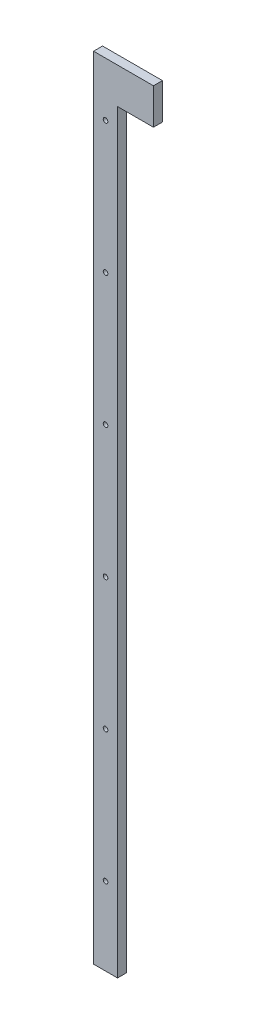
ISO-10303-21;
HEADER;
FILE_DESCRIPTION(('STEP AP214'),'2;1');
FILE_NAME('part.step','',(''),(''),'','','');
FILE_SCHEMA(('AUTOMOTIVE_DESIGN { 1 0 10303 214 1 1 1 1 }'));
ENDSEC;
DATA;
#1=APPLICATION_CONTEXT('core data for automotive mechanical design processes');
#2=APPLICATION_PROTOCOL_DEFINITION('international standard','automotive_design',2000,#1);
#3=PRODUCT_CONTEXT('',#1,'mechanical');
#4=PRODUCT('Part','Part','',(#3));
#5=PRODUCT_RELATED_PRODUCT_CATEGORY('part','',(#4));
#6=PRODUCT_DEFINITION_FORMATION('','',#4);
#7=PRODUCT_DEFINITION_CONTEXT('part definition',#1,'design');
#8=PRODUCT_DEFINITION('design','',#6,#7);
#9=PRODUCT_DEFINITION_SHAPE('','',#8);
#10=(LENGTH_UNIT() NAMED_UNIT(*) SI_UNIT(.MILLI.,.METRE.));
#11=(NAMED_UNIT(*) PLANE_ANGLE_UNIT() SI_UNIT($,.RADIAN.));
#12=(NAMED_UNIT(*) SI_UNIT($,.STERADIAN.) SOLID_ANGLE_UNIT());
#13=UNCERTAINTY_MEASURE_WITH_UNIT(LENGTH_MEASURE(1.E-05),#10,'distance_accuracy_value','');
#14=(GEOMETRIC_REPRESENTATION_CONTEXT(3) GLOBAL_UNCERTAINTY_ASSIGNED_CONTEXT((#13)) GLOBAL_UNIT_ASSIGNED_CONTEXT((#10,
#11,#12)) REPRESENTATION_CONTEXT('',''));
#15=CARTESIAN_POINT('',(0.,0.,0.));
#16=DIRECTION('',(0.,0.,1.));
#17=DIRECTION('',(1.,0.,0.));
#18=AXIS2_PLACEMENT_3D('',#15,#16,#17);
#19=CARTESIAN_POINT('',(0.,0.,9.525));
#20=DIRECTION('',(0.,0.,1.));
#21=DIRECTION('',(1.,0.,0.));
#22=AXIS2_PLACEMENT_3D('',#19,#20,#21);
#23=PLANE('',#22);
#24=CARTESIAN_POINT('',(0.,349.25,9.525));
#25=DIRECTION('',(0.,0.,-1.));
#26=DIRECTION('',(-1.,0.,0.));
#27=AXIS2_PLACEMENT_3D('',#24,#25,#26);
#28=CIRCLE('',#27,2.4384);
#29=CARTESIAN_POINT('',(-2.4384,349.25,9.525));
#30=VERTEX_POINT('',#29);
#31=EDGE_CURVE('E111',#30,#30,#28,.T.);
#32=ORIENTED_EDGE('',*,*,#31,.T.);
#33=EDGE_LOOP('',(#32));
#34=FACE_BOUND('',#33,.T.);
#35=CARTESIAN_POINT('',(0.,-349.25,9.525));
#36=DIRECTION('',(0.,0.,-1.));
#37=DIRECTION('',(-1.,0.,0.));
#38=AXIS2_PLACEMENT_3D('',#35,#36,#37);
#39=CIRCLE('',#38,2.4384);
#40=CARTESIAN_POINT('',(-2.4384,-349.25,9.525));
#41=VERTEX_POINT('',#40);
#42=EDGE_CURVE('E114',#41,#41,#39,.T.);
#43=ORIENTED_EDGE('',*,*,#42,.T.);
#44=EDGE_LOOP('',(#43));
#45=FACE_BOUND('',#44,.T.);
#46=CARTESIAN_POINT('',(0.,-209.55,9.525));
#47=DIRECTION('',(0.,0.,-1.));
#48=DIRECTION('',(-1.,0.,0.));
#49=AXIS2_PLACEMENT_3D('',#46,#47,#48);
#50=CIRCLE('',#49,2.4384);
#51=CARTESIAN_POINT('',(-2.4384,-209.55,9.525));
#52=VERTEX_POINT('',#51);
#53=EDGE_CURVE('E117',#52,#52,#50,.T.);
#54=ORIENTED_EDGE('',*,*,#53,.T.);
#55=EDGE_LOOP('',(#54));
#56=FACE_BOUND('',#55,.T.);
#57=CARTESIAN_POINT('',(0.,-69.85,9.525));
#58=DIRECTION('',(0.,0.,-1.));
#59=DIRECTION('',(-1.,0.,0.));
#60=AXIS2_PLACEMENT_3D('',#57,#58,#59);
#61=CIRCLE('',#60,2.4384);
#62=CARTESIAN_POINT('',(-2.4384,-69.85,9.525));
#63=VERTEX_POINT('',#62);
#64=EDGE_CURVE('E120',#63,#63,#61,.T.);
#65=ORIENTED_EDGE('',*,*,#64,.T.);
#66=EDGE_LOOP('',(#65));
#67=FACE_BOUND('',#66,.T.);
#68=CARTESIAN_POINT('',(0.,69.85,9.525));
#69=DIRECTION('',(0.,0.,-1.));
#70=DIRECTION('',(-1.,0.,0.));
#71=AXIS2_PLACEMENT_3D('',#68,#69,#70);
#72=CIRCLE('',#71,2.4384);
#73=CARTESIAN_POINT('',(-2.4384,69.85,9.525));
#74=VERTEX_POINT('',#73);
#75=EDGE_CURVE('E122',#74,#74,#72,.T.);
#76=ORIENTED_EDGE('',*,*,#75,.T.);
#77=EDGE_LOOP('',(#76));
#78=FACE_BOUND('',#77,.T.);
#79=CARTESIAN_POINT('',(0.,209.55,9.525));
#80=DIRECTION('',(0.,0.,-1.));
#81=DIRECTION('',(-1.,0.,0.));
#82=AXIS2_PLACEMENT_3D('',#79,#80,#81);
#83=CIRCLE('',#82,2.4384);
#84=CARTESIAN_POINT('',(-2.4384,209.55,9.525));
#85=VERTEX_POINT('',#84);
#86=EDGE_CURVE('E19',#85,#85,#83,.T.);
#87=ORIENTED_EDGE('',*,*,#86,.T.);
#88=EDGE_LOOP('',(#87));
#89=FACE_BOUND('',#88,.T.);
#90=DIRECTION('',(0.,1.,0.));
#91=VECTOR('',#90,1.);
#92=CARTESIAN_POINT('',(50.8,0.,9.525));
#93=LINE('',#92,#91);
#94=CARTESIAN_POINT('',(50.8,406.4,9.525));
#95=VERTEX_POINT('',#94);
#96=CARTESIAN_POINT('',(50.8,368.3,9.525));
#97=VERTEX_POINT('',#96);
#98=EDGE_CURVE('E84',#95,#97,#93,.F.);
#99=ORIENTED_EDGE('',*,*,#98,.F.);
#100=DIRECTION('',(1.,0.,0.));
#101=VECTOR('',#100,1.);
#102=CARTESIAN_POINT('',(-12.7,406.4,9.525));
#103=LINE('',#102,#101);
#104=CARTESIAN_POINT('',(-12.7,406.4,9.525));
#105=VERTEX_POINT('',#104);
#106=EDGE_CURVE('E80',#95,#105,#103,.F.);
#107=ORIENTED_EDGE('',*,*,#106,.T.);
#108=DIRECTION('',(0.,1.,0.));
#109=VECTOR('',#108,1.);
#110=CARTESIAN_POINT('',(-12.7,431.8,9.525));
#111=LINE('',#110,#109);
#112=CARTESIAN_POINT('',(-12.7,-431.8,9.525));
#113=VERTEX_POINT('',#112);
#114=EDGE_CURVE('E71',#113,#105,#111,.T.);
#115=ORIENTED_EDGE('',*,*,#114,.F.);
#116=DIRECTION('',(1.,0.,0.));
#117=VECTOR('',#116,1.);
#118=CARTESIAN_POINT('',(-12.7,-431.8,9.525));
#119=LINE('',#118,#117);
#120=CARTESIAN_POINT('',(12.7,-431.8,9.525));
#121=VERTEX_POINT('',#120);
#122=EDGE_CURVE('E66',#121,#113,#119,.F.);
#123=ORIENTED_EDGE('',*,*,#122,.F.);
#124=DIRECTION('',(0.,1.,0.));
#125=VECTOR('',#124,1.);
#126=CARTESIAN_POINT('',(12.7,-431.8,9.525));
#127=LINE('',#126,#125);
#128=CARTESIAN_POINT('',(12.7,368.3,9.525));
#129=VERTEX_POINT('',#128);
#130=EDGE_CURVE('E142',#129,#121,#127,.F.);
#131=ORIENTED_EDGE('',*,*,#130,.F.);
#132=DIRECTION('',(1.,0.,0.));
#133=VECTOR('',#132,1.);
#134=CARTESIAN_POINT('',(12.7,368.3,9.525));
#135=LINE('',#134,#133);
#136=EDGE_CURVE('E138',#97,#129,#135,.F.);
#137=ORIENTED_EDGE('',*,*,#136,.F.);
#138=EDGE_LOOP('',(#99,#107,#115,#123,#131,#137));
#139=FACE_BOUND('',#138,.T.);
#140=ADVANCED_FACE('F16',(#34,#45,#56,#67,#78,#89,#139),#23,.T.);
#141=CARTESIAN_POINT('',(-12.7,406.4,9.525));
#142=DIRECTION('',(0.,-1.,0.));
#143=DIRECTION('',(0.,0.,-1.));
#144=AXIS2_PLACEMENT_3D('',#141,#142,#143);
#145=PLANE('',#144);
#146=ORIENTED_EDGE('',*,*,#106,.F.);
#147=DIRECTION('',(0.,0.,-1.));
#148=VECTOR('',#147,1.);
#149=CARTESIAN_POINT('',(50.8,406.4,0.));
#150=LINE('',#149,#148);
#151=CARTESIAN_POINT('',(50.8,406.4,0.));
#152=VERTEX_POINT('',#151);
#153=EDGE_CURVE('E127',#152,#95,#150,.F.);
#154=ORIENTED_EDGE('',*,*,#153,.F.);
#155=DIRECTION('',(1.,0.,0.));
#156=VECTOR('',#155,1.);
#157=CARTESIAN_POINT('',(0.,406.4,0.));
#158=LINE('',#157,#156);
#159=CARTESIAN_POINT('',(-12.7,406.4,0.));
#160=VERTEX_POINT('',#159);
#161=EDGE_CURVE('E91',#152,#160,#158,.F.);
#162=ORIENTED_EDGE('',*,*,#161,.T.);
#163=DIRECTION('',(0.,0.,1.));
#164=VECTOR('',#163,1.);
#165=CARTESIAN_POINT('',(-12.7,406.4,0.));
#166=LINE('',#165,#164);
#167=EDGE_CURVE('E76',#105,#160,#166,.F.);
#168=ORIENTED_EDGE('',*,*,#167,.F.);
#169=EDGE_LOOP('',(#146,#154,#162,#168));
#170=FACE_BOUND('',#169,.T.);
#171=ADVANCED_FACE('F90',(#170),#145,.F.);
#172=CARTESIAN_POINT('',(-12.7,431.8,0.));
#173=DIRECTION('',(-1.,0.,0.));
#174=DIRECTION('',(0.,0.,1.));
#175=AXIS2_PLACEMENT_3D('',#172,#173,#174);
#176=PLANE('',#175);
#177=ORIENTED_EDGE('',*,*,#114,.T.);
#178=ORIENTED_EDGE('',*,*,#167,.T.);
#179=DIRECTION('',(0.,1.,0.));
#180=VECTOR('',#179,1.);
#181=CARTESIAN_POINT('',(-12.7,0.,0.));
#182=LINE('',#181,#180);
#183=CARTESIAN_POINT('',(-12.7,-431.8,0.));
#184=VERTEX_POINT('',#183);
#185=EDGE_CURVE('E151',#160,#184,#182,.F.);
#186=ORIENTED_EDGE('',*,*,#185,.T.);
#187=DIRECTION('',(0.,0.,-1.));
#188=VECTOR('',#187,1.);
#189=CARTESIAN_POINT('',(-12.7,-431.8,0.));
#190=LINE('',#189,#188);
#191=EDGE_CURVE('E78',#113,#184,#190,.T.);
#192=ORIENTED_EDGE('',*,*,#191,.F.);
#193=EDGE_LOOP('',(#177,#178,#186,#192));
#194=FACE_BOUND('',#193,.T.);
#195=ADVANCED_FACE('F73',(#194),#176,.T.);
#196=CARTESIAN_POINT('',(-12.7,-431.8,0.));
#197=DIRECTION('',(0.,-1.,0.));
#198=DIRECTION('',(0.,0.,-1.));
#199=AXIS2_PLACEMENT_3D('',#196,#197,#198);
#200=PLANE('',#199);
#201=ORIENTED_EDGE('',*,*,#191,.T.);
#202=DIRECTION('',(1.,0.,0.));
#203=VECTOR('',#202,1.);
#204=CARTESIAN_POINT('',(0.,-431.8,0.));
#205=LINE('',#204,#203);
#206=CARTESIAN_POINT('',(12.7,-431.8,0.));
#207=VERTEX_POINT('',#206);
#208=EDGE_CURVE('E146',#184,#207,#205,.T.);
#209=ORIENTED_EDGE('',*,*,#208,.T.);
#210=DIRECTION('',(0.,0.,-1.));
#211=VECTOR('',#210,1.);
#212=CARTESIAN_POINT('',(12.7,-431.8,0.));
#213=LINE('',#212,#211);
#214=EDGE_CURVE('E140',#121,#207,#213,.T.);
#215=ORIENTED_EDGE('',*,*,#214,.F.);
#216=ORIENTED_EDGE('',*,*,#122,.T.);
#217=EDGE_LOOP('',(#201,#209,#215,#216));
#218=FACE_BOUND('',#217,.T.);
#219=ADVANCED_FACE('F145',(#218),#200,.T.);
#220=CARTESIAN_POINT('',(12.7,-431.8,0.));
#221=DIRECTION('',(1.,0.,0.));
#222=DIRECTION('',(0.,0.,-1.));
#223=AXIS2_PLACEMENT_3D('',#220,#221,#222);
#224=PLANE('',#223);
#225=DIRECTION('',(0.,1.,0.));
#226=VECTOR('',#225,1.);
#227=CARTESIAN_POINT('',(12.7,0.,0.));
#228=LINE('',#227,#226);
#229=CARTESIAN_POINT('',(12.7,368.3,0.));
#230=VERTEX_POINT('',#229);
#231=EDGE_CURVE('E153',#207,#230,#228,.T.);
#232=ORIENTED_EDGE('',*,*,#231,.T.);
#233=DIRECTION('',(0.,0.,-1.));
#234=VECTOR('',#233,1.);
#235=CARTESIAN_POINT('',(12.7,368.3,9.525));
#236=LINE('',#235,#234);
#237=EDGE_CURVE('E136',#129,#230,#236,.T.);
#238=ORIENTED_EDGE('',*,*,#237,.F.);
#239=ORIENTED_EDGE('',*,*,#130,.T.);
#240=ORIENTED_EDGE('',*,*,#214,.T.);
#241=EDGE_LOOP('',(#232,#238,#239,#240));
#242=FACE_BOUND('',#241,.T.);
#243=ADVANCED_FACE('F166',(#242),#224,.T.);
#244=CARTESIAN_POINT('',(12.7,368.3,9.525));
#245=DIRECTION('',(0.,-1.,0.));
#246=DIRECTION('',(0.,0.,-1.));
#247=AXIS2_PLACEMENT_3D('',#244,#245,#246);
#248=PLANE('',#247);
#249=ORIENTED_EDGE('',*,*,#136,.T.);
#250=ORIENTED_EDGE('',*,*,#237,.T.);
#251=DIRECTION('',(1.,0.,0.));
#252=VECTOR('',#251,1.);
#253=CARTESIAN_POINT('',(0.,368.3,0.));
#254=LINE('',#253,#252);
#255=CARTESIAN_POINT('',(50.8,368.3,0.));
#256=VERTEX_POINT('',#255);
#257=EDGE_CURVE('E157',#230,#256,#254,.T.);
#258=ORIENTED_EDGE('',*,*,#257,.T.);
#259=DIRECTION('',(0.,0.,-1.));
#260=VECTOR('',#259,1.);
#261=CARTESIAN_POINT('',(50.8,368.3,0.));
#262=LINE('',#261,#260);
#263=EDGE_CURVE('E34',#97,#256,#262,.T.);
#264=ORIENTED_EDGE('',*,*,#263,.F.);
#265=EDGE_LOOP('',(#249,#250,#258,#264));
#266=FACE_BOUND('',#265,.T.);
#267=ADVANCED_FACE('F162',(#266),#248,.T.);
#268=CARTESIAN_POINT('',(50.8,0.,0.));
#269=DIRECTION('',(1.,0.,0.));
#270=DIRECTION('',(0.,0.,-1.));
#271=AXIS2_PLACEMENT_3D('',#268,#269,#270);
#272=PLANE('',#271);
#273=DIRECTION('',(0.,1.,0.));
#274=VECTOR('',#273,1.);
#275=CARTESIAN_POINT('',(50.8,0.,0.));
#276=LINE('',#275,#274);
#277=EDGE_CURVE('E110',#256,#152,#276,.T.);
#278=ORIENTED_EDGE('',*,*,#277,.T.);
#279=ORIENTED_EDGE('',*,*,#153,.T.);
#280=ORIENTED_EDGE('',*,*,#98,.T.);
#281=ORIENTED_EDGE('',*,*,#263,.T.);
#282=EDGE_LOOP('',(#278,#279,#280,#281));
#283=FACE_BOUND('',#282,.T.);
#284=ADVANCED_FACE('F160',(#283),#272,.T.);
#285=CARTESIAN_POINT('',(0.,209.55,9.525));
#286=DIRECTION('',(0.,0.,-1.));
#287=DIRECTION('',(-1.,0.,0.));
#288=AXIS2_PLACEMENT_3D('',#285,#286,#287);
#289=CYLINDRICAL_SURFACE('',#288,2.4384);
#290=ORIENTED_EDGE('',*,*,#86,.F.);
#291=EDGE_LOOP('',(#290));
#292=FACE_BOUND('',#291,.T.);
#293=CARTESIAN_POINT('',(0.,209.55,0.));
#294=DIRECTION('',(0.,0.,-1.));
#295=DIRECTION('',(-1.,0.,0.));
#296=AXIS2_PLACEMENT_3D('',#293,#294,#295);
#297=CIRCLE('',#296,2.4384);
#298=CARTESIAN_POINT('',(-2.4384,209.55,0.));
#299=VERTEX_POINT('',#298);
#300=EDGE_CURVE('E107',#299,#299,#297,.T.);
#301=ORIENTED_EDGE('',*,*,#300,.T.);
#302=EDGE_LOOP('',(#301));
#303=FACE_BOUND('',#302,.T.);
#304=ADVANCED_FACE('F203',(#292,#303),#289,.F.);
#305=CARTESIAN_POINT('',(0.,69.85,9.525));
#306=DIRECTION('',(0.,0.,-1.));
#307=DIRECTION('',(-1.,0.,0.));
#308=AXIS2_PLACEMENT_3D('',#305,#306,#307);
#309=CYLINDRICAL_SURFACE('',#308,2.4384);
#310=ORIENTED_EDGE('',*,*,#75,.F.);
#311=EDGE_LOOP('',(#310));
#312=FACE_BOUND('',#311,.T.);
#313=CARTESIAN_POINT('',(0.,69.85,0.));
#314=DIRECTION('',(0.,0.,-1.));
#315=DIRECTION('',(-1.,0.,0.));
#316=AXIS2_PLACEMENT_3D('',#313,#314,#315);
#317=CIRCLE('',#316,2.4384);
#318=CARTESIAN_POINT('',(-2.4384,69.85,0.));
#319=VERTEX_POINT('',#318);
#320=EDGE_CURVE('E104',#319,#319,#317,.T.);
#321=ORIENTED_EDGE('',*,*,#320,.T.);
#322=EDGE_LOOP('',(#321));
#323=FACE_BOUND('',#322,.T.);
#324=ADVANCED_FACE('F199',(#312,#323),#309,.F.);
#325=CARTESIAN_POINT('',(0.,-69.85,9.525));
#326=DIRECTION('',(0.,0.,-1.));
#327=DIRECTION('',(-1.,0.,0.));
#328=AXIS2_PLACEMENT_3D('',#325,#326,#327);
#329=CYLINDRICAL_SURFACE('',#328,2.4384);
#330=ORIENTED_EDGE('',*,*,#64,.F.);
#331=EDGE_LOOP('',(#330));
#332=FACE_BOUND('',#331,.T.);
#333=CARTESIAN_POINT('',(0.,-69.85,0.));
#334=DIRECTION('',(0.,0.,-1.));
#335=DIRECTION('',(-1.,0.,0.));
#336=AXIS2_PLACEMENT_3D('',#333,#334,#335);
#337=CIRCLE('',#336,2.4384);
#338=CARTESIAN_POINT('',(-2.4384,-69.85,0.));
#339=VERTEX_POINT('',#338);
#340=EDGE_CURVE('E101',#339,#339,#337,.T.);
#341=ORIENTED_EDGE('',*,*,#340,.T.);
#342=EDGE_LOOP('',(#341));
#343=FACE_BOUND('',#342,.T.);
#344=ADVANCED_FACE('F195',(#332,#343),#329,.F.);
#345=CARTESIAN_POINT('',(0.,-209.55,9.525));
#346=DIRECTION('',(0.,0.,-1.));
#347=DIRECTION('',(-1.,0.,0.));
#348=AXIS2_PLACEMENT_3D('',#345,#346,#347);
#349=CYLINDRICAL_SURFACE('',#348,2.4384);
#350=ORIENTED_EDGE('',*,*,#53,.F.);
#351=EDGE_LOOP('',(#350));
#352=FACE_BOUND('',#351,.T.);
#353=CARTESIAN_POINT('',(0.,-209.55,0.));
#354=DIRECTION('',(0.,0.,-1.));
#355=DIRECTION('',(-1.,0.,0.));
#356=AXIS2_PLACEMENT_3D('',#353,#354,#355);
#357=CIRCLE('',#356,2.4384);
#358=CARTESIAN_POINT('',(-2.4384,-209.55,0.));
#359=VERTEX_POINT('',#358);
#360=EDGE_CURVE('E98',#359,#359,#357,.T.);
#361=ORIENTED_EDGE('',*,*,#360,.T.);
#362=EDGE_LOOP('',(#361));
#363=FACE_BOUND('',#362,.T.);
#364=ADVANCED_FACE('F191',(#352,#363),#349,.F.);
#365=CARTESIAN_POINT('',(0.,-349.25,9.525));
#366=DIRECTION('',(0.,0.,-1.));
#367=DIRECTION('',(-1.,0.,0.));
#368=AXIS2_PLACEMENT_3D('',#365,#366,#367);
#369=CYLINDRICAL_SURFACE('',#368,2.4384);
#370=ORIENTED_EDGE('',*,*,#42,.F.);
#371=EDGE_LOOP('',(#370));
#372=FACE_BOUND('',#371,.T.);
#373=CARTESIAN_POINT('',(0.,-349.25,0.));
#374=DIRECTION('',(0.,0.,-1.));
#375=DIRECTION('',(-1.,0.,0.));
#376=AXIS2_PLACEMENT_3D('',#373,#374,#375);
#377=CIRCLE('',#376,2.4384);
#378=CARTESIAN_POINT('',(-2.4384,-349.25,0.));
#379=VERTEX_POINT('',#378);
#380=EDGE_CURVE('E25',#379,#379,#377,.T.);
#381=ORIENTED_EDGE('',*,*,#380,.T.);
#382=EDGE_LOOP('',(#381));
#383=FACE_BOUND('',#382,.T.);
#384=ADVANCED_FACE('F183',(#372,#383),#369,.F.);
#385=CARTESIAN_POINT('',(0.,349.25,9.525));
#386=DIRECTION('',(0.,0.,-1.));
#387=DIRECTION('',(-1.,0.,0.));
#388=AXIS2_PLACEMENT_3D('',#385,#386,#387);
#389=CYLINDRICAL_SURFACE('',#388,2.4384);
#390=ORIENTED_EDGE('',*,*,#31,.F.);
#391=EDGE_LOOP('',(#390));
#392=FACE_BOUND('',#391,.T.);
#393=CARTESIAN_POINT('',(0.,349.25,0.));
#394=DIRECTION('',(0.,0.,-1.));
#395=DIRECTION('',(-1.,0.,0.));
#396=AXIS2_PLACEMENT_3D('',#393,#394,#395);
#397=CIRCLE('',#396,2.4384);
#398=CARTESIAN_POINT('',(-2.4384,349.25,0.));
#399=VERTEX_POINT('',#398);
#400=EDGE_CURVE('E11',#399,#399,#397,.T.);
#401=ORIENTED_EDGE('',*,*,#400,.T.);
#402=EDGE_LOOP('',(#401));
#403=FACE_BOUND('',#402,.T.);
#404=ADVANCED_FACE('F177',(#392,#403),#389,.F.);
#405=CARTESIAN_POINT('',(0.,0.,0.));
#406=DIRECTION('',(0.,0.,1.));
#407=DIRECTION('',(1.,0.,0.));
#408=AXIS2_PLACEMENT_3D('',#405,#406,#407);
#409=PLANE('',#408);
#410=ORIENTED_EDGE('',*,*,#400,.F.);
#411=EDGE_LOOP('',(#410));
#412=FACE_BOUND('',#411,.T.);
#413=ORIENTED_EDGE('',*,*,#380,.F.);
#414=EDGE_LOOP('',(#413));
#415=FACE_BOUND('',#414,.T.);
#416=ORIENTED_EDGE('',*,*,#360,.F.);
#417=EDGE_LOOP('',(#416));
#418=FACE_BOUND('',#417,.T.);
#419=ORIENTED_EDGE('',*,*,#340,.F.);
#420=EDGE_LOOP('',(#419));
#421=FACE_BOUND('',#420,.T.);
#422=ORIENTED_EDGE('',*,*,#320,.F.);
#423=EDGE_LOOP('',(#422));
#424=FACE_BOUND('',#423,.T.);
#425=ORIENTED_EDGE('',*,*,#300,.F.);
#426=EDGE_LOOP('',(#425));
#427=FACE_BOUND('',#426,.T.);
#428=ORIENTED_EDGE('',*,*,#257,.F.);
#429=ORIENTED_EDGE('',*,*,#231,.F.);
#430=ORIENTED_EDGE('',*,*,#208,.F.);
#431=ORIENTED_EDGE('',*,*,#185,.F.);
#432=ORIENTED_EDGE('',*,*,#161,.F.);
#433=ORIENTED_EDGE('',*,*,#277,.F.);
#434=EDGE_LOOP('',(#428,#429,#430,#431,#432,#433));
#435=FACE_BOUND('',#434,.T.);
#436=ADVANCED_FACE('F150',(#412,#415,#418,#421,#424,#427,#435),#409,.F.);
#437=CLOSED_SHELL('',(#140,#171,#195,#219,#243,#267,#284,#304,#324,#344,#364,#384,#404,#436));
#438=MANIFOLD_SOLID_BREP('B1',#437);
#439=ADVANCED_BREP_SHAPE_REPRESENTATION('',(#18,#438),#14);
#440=SHAPE_DEFINITION_REPRESENTATION(#9,#439);
ENDSEC;
END-ISO-10303-21;
